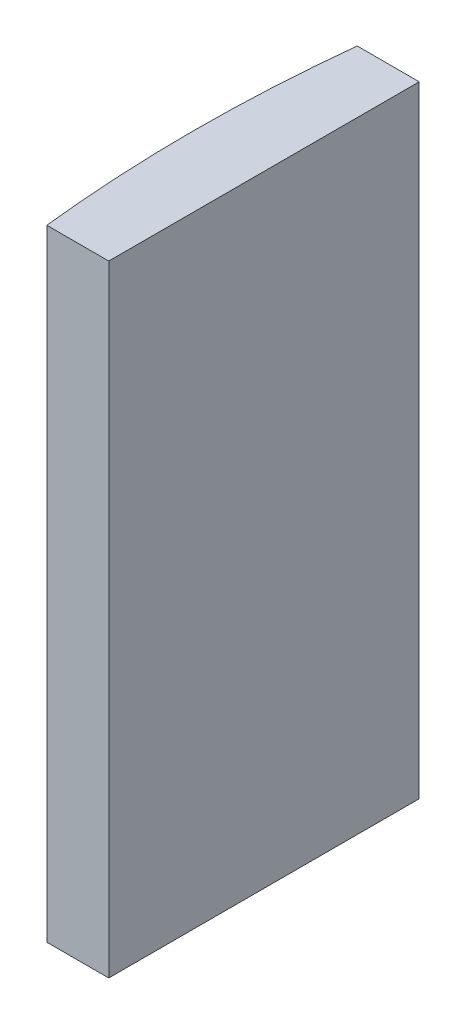
ISO-10303-21;
HEADER;
FILE_DESCRIPTION(('STEP AP214'),'2;1');
FILE_NAME('part.step','',(''),(''),'','','');
FILE_SCHEMA(('AUTOMOTIVE_DESIGN { 1 0 10303 214 1 1 1 1 }'));
ENDSEC;
DATA;
#1=APPLICATION_CONTEXT('core data for automotive mechanical design processes');
#2=APPLICATION_PROTOCOL_DEFINITION('international standard','automotive_design',2000,#1);
#3=PRODUCT_CONTEXT('',#1,'mechanical');
#4=PRODUCT('Part','Part','',(#3));
#5=PRODUCT_RELATED_PRODUCT_CATEGORY('part','',(#4));
#6=PRODUCT_DEFINITION_FORMATION('','',#4);
#7=PRODUCT_DEFINITION_CONTEXT('part definition',#1,'design');
#8=PRODUCT_DEFINITION('design','',#6,#7);
#9=PRODUCT_DEFINITION_SHAPE('','',#8);
#10=(LENGTH_UNIT() NAMED_UNIT(*) SI_UNIT(.MILLI.,.METRE.));
#11=(NAMED_UNIT(*) PLANE_ANGLE_UNIT() SI_UNIT($,.RADIAN.));
#12=(NAMED_UNIT(*) SI_UNIT($,.STERADIAN.) SOLID_ANGLE_UNIT());
#13=UNCERTAINTY_MEASURE_WITH_UNIT(LENGTH_MEASURE(1.E-05),#10,'distance_accuracy_value','');
#14=(GEOMETRIC_REPRESENTATION_CONTEXT(3) GLOBAL_UNCERTAINTY_ASSIGNED_CONTEXT((#13)) GLOBAL_UNIT_ASSIGNED_CONTEXT((#10,
#11,#12)) REPRESENTATION_CONTEXT('',''));
#15=CARTESIAN_POINT('',(0.,0.,0.));
#16=DIRECTION('',(0.,0.,1.));
#17=DIRECTION('',(1.,0.,0.));
#18=AXIS2_PLACEMENT_3D('',#15,#16,#17);
#19=CARTESIAN_POINT('',(4.35520433485127,20.,0.));
#20=DIRECTION('',(0.,-1.,0.));
#21=DIRECTION('',(0.,0.,-1.));
#22=AXIS2_PLACEMENT_3D('',#19,#20,#21);
#23=CYLINDRICAL_SURFACE('',#22,45.85);
#24=CARTESIAN_POINT('',(4.35520433485127,0.,0.));
#25=DIRECTION('',(0.,1.,0.));
#26=DIRECTION('',(0.,0.,1.));
#27=AXIS2_PLACEMENT_3D('',#24,#25,#26);
#28=CIRCLE('',#27,45.85);
#29=CARTESIAN_POINT('',(-41.2213521388447,0.,-5.));
#30=VERTEX_POINT('',#29);
#31=CARTESIAN_POINT('',(-41.2213521388447,0.,5.));
#32=VERTEX_POINT('',#31);
#33=EDGE_CURVE('E100',#30,#32,#28,.T.);
#34=ORIENTED_EDGE('',*,*,#33,.T.);
#35=DIRECTION('',(0.,-1.,0.));
#36=VECTOR('',#35,1.);
#37=CARTESIAN_POINT('',(-41.2213521388447,20.,5.));
#38=LINE('',#37,#36);
#39=CARTESIAN_POINT('',(-41.2213521388447,20.,5.));
#40=VERTEX_POINT('',#39);
#41=EDGE_CURVE('E11',#40,#32,#38,.T.);
#42=ORIENTED_EDGE('',*,*,#41,.F.);
#43=CARTESIAN_POINT('',(4.35520433485127,20.,0.));
#44=DIRECTION('',(0.,1.,0.));
#45=DIRECTION('',(0.,0.,1.));
#46=AXIS2_PLACEMENT_3D('',#43,#44,#45);
#47=CIRCLE('',#46,45.85);
#48=CARTESIAN_POINT('',(-41.2213521388447,20.,-5.));
#49=VERTEX_POINT('',#48);
#50=EDGE_CURVE('E88',#49,#40,#47,.T.);
#51=ORIENTED_EDGE('',*,*,#50,.F.);
#52=DIRECTION('',(0.,-1.,0.));
#53=VECTOR('',#52,1.);
#54=CARTESIAN_POINT('',(-41.2213521388447,20.,-5.));
#55=LINE('',#54,#53);
#56=EDGE_CURVE('E96',#49,#30,#55,.T.);
#57=ORIENTED_EDGE('',*,*,#56,.T.);
#58=EDGE_LOOP('',(#34,#42,#51,#57));
#59=FACE_BOUND('',#58,.T.);
#60=ADVANCED_FACE('F37',(#59),#23,.T.);
#61=CARTESIAN_POINT('',(-41.2213521388447,20.,5.));
#62=DIRECTION('',(0.,0.,-1.));
#63=DIRECTION('',(-1.,0.,0.));
#64=AXIS2_PLACEMENT_3D('',#61,#62,#63);
#65=PLANE('',#64);
#66=DIRECTION('',(1.,0.,0.));
#67=VECTOR('',#66,1.);
#68=CARTESIAN_POINT('',(-41.2213521388447,0.,5.));
#69=LINE('',#68,#67);
#70=CARTESIAN_POINT('',(-39.2247956651487,0.,5.));
#71=VERTEX_POINT('',#70);
#72=EDGE_CURVE('E92',#32,#71,#69,.T.);
#73=ORIENTED_EDGE('',*,*,#72,.T.);
#74=DIRECTION('',(0.,-1.,0.));
#75=VECTOR('',#74,1.);
#76=CARTESIAN_POINT('',(-39.2247956651487,20.,5.));
#77=LINE('',#76,#75);
#78=CARTESIAN_POINT('',(-39.2247956651487,20.,5.));
#79=VERTEX_POINT('',#78);
#80=EDGE_CURVE('E45',#79,#71,#77,.T.);
#81=ORIENTED_EDGE('',*,*,#80,.F.);
#82=DIRECTION('',(1.,0.,0.));
#83=VECTOR('',#82,1.);
#84=CARTESIAN_POINT('',(-41.2213521388447,20.,5.));
#85=LINE('',#84,#83);
#86=EDGE_CURVE('E83',#40,#79,#85,.T.);
#87=ORIENTED_EDGE('',*,*,#86,.F.);
#88=ORIENTED_EDGE('',*,*,#41,.T.);
#89=EDGE_LOOP('',(#73,#81,#87,#88));
#90=FACE_BOUND('',#89,.T.);
#91=ADVANCED_FACE('F91',(#90),#65,.F.);
#92=CARTESIAN_POINT('',(-39.2247956651487,20.,-5.));
#93=DIRECTION('',(-1.,0.,0.));
#94=DIRECTION('',(0.,0.,1.));
#95=AXIS2_PLACEMENT_3D('',#92,#93,#94);
#96=PLANE('',#95);
#97=DIRECTION('',(0.,0.,-1.));
#98=VECTOR('',#97,1.);
#99=CARTESIAN_POINT('',(-39.2247956651487,0.,-5.));
#100=LINE('',#99,#98);
#101=CARTESIAN_POINT('',(-39.2247956651487,0.,-5.));
#102=VERTEX_POINT('',#101);
#103=EDGE_CURVE('E70',#71,#102,#100,.T.);
#104=ORIENTED_EDGE('',*,*,#103,.T.);
#105=DIRECTION('',(0.,-1.,0.));
#106=VECTOR('',#105,1.);
#107=CARTESIAN_POINT('',(-39.2247956651487,20.,-5.));
#108=LINE('',#107,#106);
#109=CARTESIAN_POINT('',(-39.2247956651487,20.,-5.));
#110=VERTEX_POINT('',#109);
#111=EDGE_CURVE('E93',#110,#102,#108,.T.);
#112=ORIENTED_EDGE('',*,*,#111,.F.);
#113=DIRECTION('',(0.,0.,-1.));
#114=VECTOR('',#113,1.);
#115=CARTESIAN_POINT('',(-39.2247956651487,20.,-5.));
#116=LINE('',#115,#114);
#117=EDGE_CURVE('E86',#79,#110,#116,.T.);
#118=ORIENTED_EDGE('',*,*,#117,.F.);
#119=ORIENTED_EDGE('',*,*,#80,.T.);
#120=EDGE_LOOP('',(#104,#112,#118,#119));
#121=FACE_BOUND('',#120,.T.);
#122=ADVANCED_FACE('F94',(#121),#96,.F.);
#123=CARTESIAN_POINT('',(-41.2213521388447,20.,-5.));
#124=DIRECTION('',(0.,0.,1.));
#125=DIRECTION('',(1.,0.,0.));
#126=AXIS2_PLACEMENT_3D('',#123,#124,#125);
#127=PLANE('',#126);
#128=DIRECTION('',(-1.,0.,0.));
#129=VECTOR('',#128,1.);
#130=CARTESIAN_POINT('',(-41.2213521388447,0.,-5.));
#131=LINE('',#130,#129);
#132=EDGE_CURVE('E76',#102,#30,#131,.T.);
#133=ORIENTED_EDGE('',*,*,#132,.T.);
#134=ORIENTED_EDGE('',*,*,#56,.F.);
#135=DIRECTION('',(-1.,0.,0.));
#136=VECTOR('',#135,1.);
#137=CARTESIAN_POINT('',(-41.2213521388447,20.,-5.));
#138=LINE('',#137,#136);
#139=EDGE_CURVE('E53',#110,#49,#138,.T.);
#140=ORIENTED_EDGE('',*,*,#139,.F.);
#141=ORIENTED_EDGE('',*,*,#111,.T.);
#142=EDGE_LOOP('',(#133,#134,#140,#141));
#143=FACE_BOUND('',#142,.T.);
#144=ADVANCED_FACE('F107',(#143),#127,.F.);
#145=CARTESIAN_POINT('',(4.35520433485127,20.,0.));
#146=DIRECTION('',(0.,1.,0.));
#147=DIRECTION('',(0.,0.,1.));
#148=AXIS2_PLACEMENT_3D('',#145,#146,#147);
#149=PLANE('',#148);
#150=ORIENTED_EDGE('',*,*,#50,.T.);
#151=ORIENTED_EDGE('',*,*,#86,.T.);
#152=ORIENTED_EDGE('',*,*,#117,.T.);
#153=ORIENTED_EDGE('',*,*,#139,.T.);
#154=EDGE_LOOP('',(#150,#151,#152,#153));
#155=FACE_BOUND('',#154,.T.);
#156=ADVANCED_FACE('F84',(#155),#149,.T.);
#157=CARTESIAN_POINT('',(4.35520433485127,0.,0.));
#158=DIRECTION('',(0.,1.,0.));
#159=DIRECTION('',(0.,0.,1.));
#160=AXIS2_PLACEMENT_3D('',#157,#158,#159);
#161=PLANE('',#160);
#162=ORIENTED_EDGE('',*,*,#33,.F.);
#163=ORIENTED_EDGE('',*,*,#132,.F.);
#164=ORIENTED_EDGE('',*,*,#103,.F.);
#165=ORIENTED_EDGE('',*,*,#72,.F.);
#166=EDGE_LOOP('',(#162,#163,#164,#165));
#167=FACE_BOUND('',#166,.T.);
#168=ADVANCED_FACE('F110',(#167),#161,.F.);
#169=CLOSED_SHELL('',(#60,#91,#122,#144,#156,#168));
#170=MANIFOLD_SOLID_BREP('B2',#169);
#171=ADVANCED_BREP_SHAPE_REPRESENTATION('',(#18,#170),#14);
#172=SHAPE_DEFINITION_REPRESENTATION(#9,#171);
ENDSEC;
END-ISO-10303-21;
